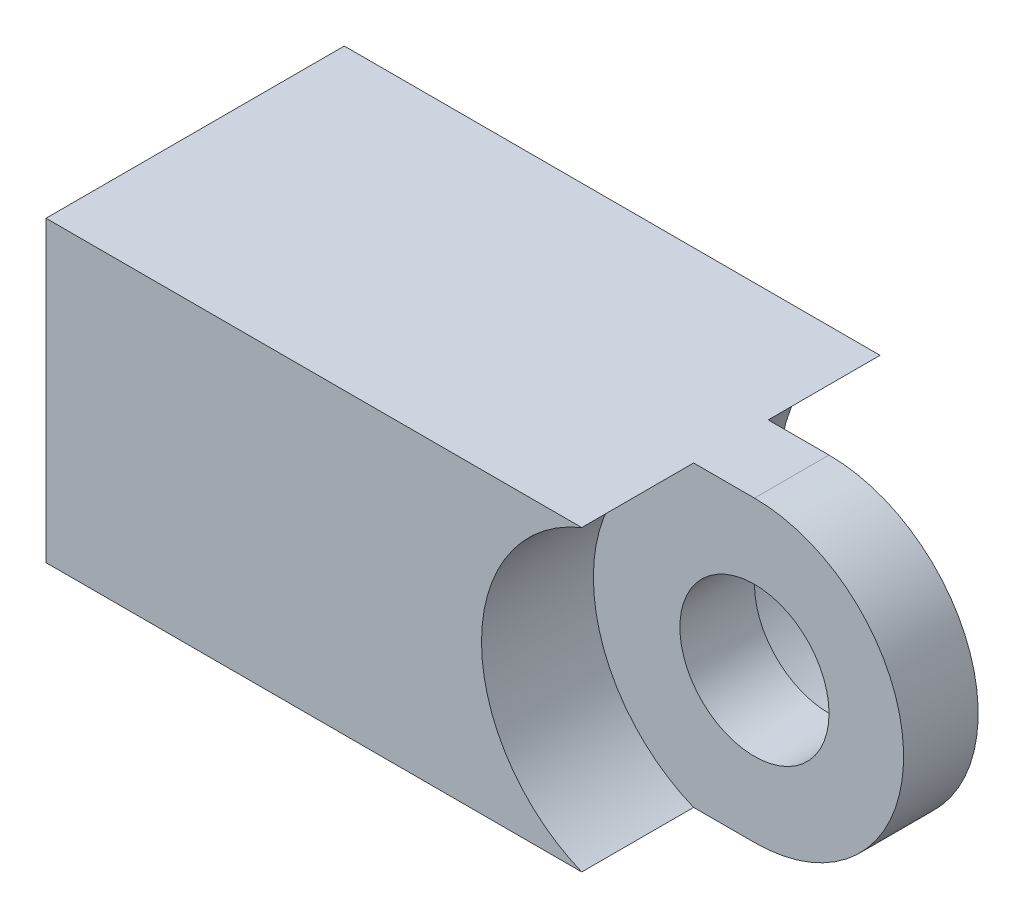
ISO-10303-21;
HEADER;
FILE_DESCRIPTION(('STEP AP214'),'2;1');
FILE_NAME('part.step','',(''),(''),'','','');
FILE_SCHEMA(('AUTOMOTIVE_DESIGN { 1 0 10303 214 1 1 1 1 }'));
ENDSEC;
DATA;
#1=APPLICATION_CONTEXT('core data for automotive mechanical design processes');
#2=APPLICATION_PROTOCOL_DEFINITION('international standard','automotive_design',2000,#1);
#3=PRODUCT_CONTEXT('',#1,'mechanical');
#4=PRODUCT('Part','Part','',(#3));
#5=PRODUCT_RELATED_PRODUCT_CATEGORY('part','',(#4));
#6=PRODUCT_DEFINITION_FORMATION('','',#4);
#7=PRODUCT_DEFINITION_CONTEXT('part definition',#1,'design');
#8=PRODUCT_DEFINITION('design','',#6,#7);
#9=PRODUCT_DEFINITION_SHAPE('','',#8);
#10=(LENGTH_UNIT() NAMED_UNIT(*) SI_UNIT(.MILLI.,.METRE.));
#11=(NAMED_UNIT(*) PLANE_ANGLE_UNIT() SI_UNIT($,.RADIAN.));
#12=(NAMED_UNIT(*) SI_UNIT($,.STERADIAN.) SOLID_ANGLE_UNIT());
#13=UNCERTAINTY_MEASURE_WITH_UNIT(LENGTH_MEASURE(1.E-05),#10,'distance_accuracy_value','');
#14=(GEOMETRIC_REPRESENTATION_CONTEXT(3) GLOBAL_UNCERTAINTY_ASSIGNED_CONTEXT((#13)) GLOBAL_UNIT_ASSIGNED_CONTEXT((#10,
#11,#12)) REPRESENTATION_CONTEXT('',''));
#15=CARTESIAN_POINT('',(0.,0.,0.));
#16=DIRECTION('',(0.,0.,1.));
#17=DIRECTION('',(1.,0.,0.));
#18=AXIS2_PLACEMENT_3D('',#15,#16,#17);
#19=CARTESIAN_POINT('',(0.,0.,0.79375));
#20=DIRECTION('',(0.,0.,-1.));
#21=DIRECTION('',(-1.,0.,0.));
#22=AXIS2_PLACEMENT_3D('',#19,#20,#21);
#23=PLANE('',#22);
#24=CARTESIAN_POINT('',(0.,0.,0.79375));
#25=DIRECTION('',(0.,0.,-1.));
#26=DIRECTION('',(-1.,0.,0.));
#27=AXIS2_PLACEMENT_3D('',#24,#25,#26);
#28=CIRCLE('',#27,3.429);
#29=CARTESIAN_POINT('',(-1.29515095645257,-3.175,0.79375));
#30=VERTEX_POINT('',#29);
#31=CARTESIAN_POINT('',(-1.29515095645257,3.175,0.79375));
#32=VERTEX_POINT('',#31);
#33=EDGE_CURVE('E180',#30,#32,#28,.T.);
#34=ORIENTED_EDGE('',*,*,#33,.F.);
#35=DIRECTION('',(1.,0.,0.));
#36=VECTOR('',#35,1.);
#37=CARTESIAN_POINT('',(-6.35,-3.175,0.79375));
#38=LINE('',#37,#36);
#39=CARTESIAN_POINT('',(0.,-3.175,0.79375));
#40=VERTEX_POINT('',#39);
#41=EDGE_CURVE('E206',#30,#40,#38,.T.);
#42=ORIENTED_EDGE('',*,*,#41,.T.);
#43=CARTESIAN_POINT('',(0.,0.,0.79375));
#44=DIRECTION('',(0.,0.,1.));
#45=DIRECTION('',(-1.,0.,0.));
#46=AXIS2_PLACEMENT_3D('',#43,#44,#45);
#47=CIRCLE('',#46,3.175);
#48=CARTESIAN_POINT('',(0.,3.175,0.79375));
#49=VERTEX_POINT('',#48);
#50=EDGE_CURVE('E73',#40,#49,#47,.T.);
#51=ORIENTED_EDGE('',*,*,#50,.T.);
#52=DIRECTION('',(-1.,0.,0.));
#53=VECTOR('',#52,1.);
#54=CARTESIAN_POINT('',(-6.35,3.175,0.79375));
#55=LINE('',#54,#53);
#56=EDGE_CURVE('E212',#49,#32,#55,.T.);
#57=ORIENTED_EDGE('',*,*,#56,.T.);
#58=EDGE_LOOP('',(#34,#42,#51,#57));
#59=FACE_BOUND('',#58,.T.);
#60=CARTESIAN_POINT('',(0.,0.,0.79375));
#61=DIRECTION('',(0.,0.,1.));
#62=DIRECTION('',(1.,0.,0.));
#63=AXIS2_PLACEMENT_3D('',#60,#61,#62);
#64=CIRCLE('',#63,1.5875);
#65=CARTESIAN_POINT('',(1.5875,0.,0.79375));
#66=VERTEX_POINT('',#65);
#67=EDGE_CURVE('E260',#66,#66,#64,.T.);
#68=ORIENTED_EDGE('',*,*,#67,.F.);
#69=EDGE_LOOP('',(#68));
#70=FACE_BOUND('',#69,.T.);
#71=ADVANCED_FACE('F52',(#59,#70),#23,.F.);
#72=CARTESIAN_POINT('',(0.,0.,-0.79375));
#73=DIRECTION('',(0.,0.,-1.));
#74=DIRECTION('',(-1.,0.,0.));
#75=AXIS2_PLACEMENT_3D('',#72,#73,#74);
#76=PLANE('',#75);
#77=CARTESIAN_POINT('',(0.,0.,-0.79375));
#78=DIRECTION('',(0.,0.,-1.));
#79=DIRECTION('',(-1.,0.,0.));
#80=AXIS2_PLACEMENT_3D('',#77,#78,#79);
#81=CIRCLE('',#80,1.5875);
#82=CARTESIAN_POINT('',(-1.5875,0.,-0.79375));
#83=VERTEX_POINT('',#82);
#84=EDGE_CURVE('E165',#83,#83,#81,.T.);
#85=ORIENTED_EDGE('',*,*,#84,.F.);
#86=EDGE_LOOP('',(#85));
#87=FACE_BOUND('',#86,.T.);
#88=DIRECTION('',(1.,0.,0.));
#89=VECTOR('',#88,1.);
#90=CARTESIAN_POINT('',(-6.35,-3.175,-0.79375));
#91=LINE('',#90,#89);
#92=CARTESIAN_POINT('',(-1.29515095645257,-3.175,-0.79375));
#93=VERTEX_POINT('',#92);
#94=CARTESIAN_POINT('',(0.,-3.175,-0.79375));
#95=VERTEX_POINT('',#94);
#96=EDGE_CURVE('E88',#93,#95,#91,.T.);
#97=ORIENTED_EDGE('',*,*,#96,.F.);
#98=CARTESIAN_POINT('',(0.,0.,-0.79375));
#99=DIRECTION('',(0.,0.,-1.));
#100=DIRECTION('',(-1.,0.,0.));
#101=AXIS2_PLACEMENT_3D('',#98,#99,#100);
#102=CIRCLE('',#101,3.429);
#103=CARTESIAN_POINT('',(-1.29515095645257,3.175,-0.79375));
#104=VERTEX_POINT('',#103);
#105=EDGE_CURVE('E11',#93,#104,#102,.T.);
#106=ORIENTED_EDGE('',*,*,#105,.T.);
#107=DIRECTION('',(-1.,0.,0.));
#108=VECTOR('',#107,1.);
#109=CARTESIAN_POINT('',(-6.35,3.175,-0.79375));
#110=LINE('',#109,#108);
#111=CARTESIAN_POINT('',(0.,3.175,-0.79375));
#112=VERTEX_POINT('',#111);
#113=EDGE_CURVE('E209',#112,#104,#110,.T.);
#114=ORIENTED_EDGE('',*,*,#113,.F.);
#115=CARTESIAN_POINT('',(0.,0.,-0.79375));
#116=DIRECTION('',(0.,0.,1.));
#117=DIRECTION('',(-1.,0.,0.));
#118=AXIS2_PLACEMENT_3D('',#115,#116,#117);
#119=CIRCLE('',#118,3.175);
#120=EDGE_CURVE('E218',#95,#112,#119,.T.);
#121=ORIENTED_EDGE('',*,*,#120,.F.);
#122=EDGE_LOOP('',(#97,#106,#114,#121));
#123=FACE_BOUND('',#122,.T.);
#124=ADVANCED_FACE('F232',(#87,#123),#76,.T.);
#125=CARTESIAN_POINT('',(-6.35,-3.175,0.79375));
#126=DIRECTION('',(0.,1.,0.));
#127=DIRECTION('',(-1.,0.,0.));
#128=AXIS2_PLACEMENT_3D('',#125,#126,#127);
#129=PLANE('',#128);
#130=DIRECTION('',(0.,0.,-1.));
#131=VECTOR('',#130,1.);
#132=CARTESIAN_POINT('',(-1.29515095645257,-3.175,3.175));
#133=LINE('',#132,#131);
#134=CARTESIAN_POINT('',(-1.29515095645257,-3.175,-3.175));
#135=VERTEX_POINT('',#134);
#136=EDGE_CURVE('E176',#93,#135,#133,.T.);
#137=ORIENTED_EDGE('',*,*,#136,.F.);
#138=ORIENTED_EDGE('',*,*,#96,.T.);
#139=DIRECTION('',(0.,0.,-1.));
#140=VECTOR('',#139,1.);
#141=CARTESIAN_POINT('',(0.,-3.175,0.79375));
#142=LINE('',#141,#140);
#143=EDGE_CURVE('E62',#40,#95,#142,.T.);
#144=ORIENTED_EDGE('',*,*,#143,.F.);
#145=ORIENTED_EDGE('',*,*,#41,.F.);
#146=CARTESIAN_POINT('',(-1.29515095645257,-3.175,3.175));
#147=VERTEX_POINT('',#146);
#148=EDGE_CURVE('E177',#147,#30,#133,.T.);
#149=ORIENTED_EDGE('',*,*,#148,.F.);
#150=DIRECTION('',(1.,0.,0.));
#151=VECTOR('',#150,1.);
#152=CARTESIAN_POINT('',(-12.7,-3.175,3.175));
#153=LINE('',#152,#151);
#154=CARTESIAN_POINT('',(-12.7,-3.175,3.175));
#155=VERTEX_POINT('',#154);
#156=EDGE_CURVE('E194',#155,#147,#153,.T.);
#157=ORIENTED_EDGE('',*,*,#156,.F.);
#158=DIRECTION('',(0.,0.,1.));
#159=VECTOR('',#158,1.);
#160=CARTESIAN_POINT('',(-12.7,-3.175,-3.175));
#161=LINE('',#160,#159);
#162=CARTESIAN_POINT('',(-12.7,-3.175,-3.175));
#163=VERTEX_POINT('',#162);
#164=EDGE_CURVE('E101',#163,#155,#161,.T.);
#165=ORIENTED_EDGE('',*,*,#164,.F.);
#166=DIRECTION('',(1.,0.,0.));
#167=VECTOR('',#166,1.);
#168=CARTESIAN_POINT('',(-12.7,-3.175,-3.175));
#169=LINE('',#168,#167);
#170=EDGE_CURVE('E197',#163,#135,#169,.T.);
#171=ORIENTED_EDGE('',*,*,#170,.T.);
#172=EDGE_LOOP('',(#137,#138,#144,#145,#149,#157,#165,#171));
#173=FACE_BOUND('',#172,.T.);
#174=ADVANCED_FACE('F54',(#173),#129,.F.);
#175=CARTESIAN_POINT('',(0.,0.,0.79375));
#176=DIRECTION('',(0.,0.,-1.));
#177=DIRECTION('',(-1.,0.,0.));
#178=AXIS2_PLACEMENT_3D('',#175,#176,#177);
#179=CYLINDRICAL_SURFACE('',#178,3.175);
#180=ORIENTED_EDGE('',*,*,#120,.T.);
#181=DIRECTION('',(0.,0.,-1.));
#182=VECTOR('',#181,1.);
#183=CARTESIAN_POINT('',(0.,3.175,0.79375));
#184=LINE('',#183,#182);
#185=EDGE_CURVE('E215',#49,#112,#184,.T.);
#186=ORIENTED_EDGE('',*,*,#185,.F.);
#187=ORIENTED_EDGE('',*,*,#50,.F.);
#188=ORIENTED_EDGE('',*,*,#143,.T.);
#189=EDGE_LOOP('',(#180,#186,#187,#188));
#190=FACE_BOUND('',#189,.T.);
#191=ADVANCED_FACE('F228',(#190),#179,.T.);
#192=CARTESIAN_POINT('',(-6.35,3.175,0.79375));
#193=DIRECTION('',(0.,-1.,0.));
#194=DIRECTION('',(0.,0.,-1.));
#195=AXIS2_PLACEMENT_3D('',#192,#193,#194);
#196=PLANE('',#195);
#197=DIRECTION('',(0.,0.,-1.));
#198=VECTOR('',#197,1.);
#199=CARTESIAN_POINT('',(-1.29515095645257,3.175,3.175));
#200=LINE('',#199,#198);
#201=CARTESIAN_POINT('',(-1.29515095645257,3.175,3.175));
#202=VERTEX_POINT('',#201);
#203=EDGE_CURVE('E172',#202,#32,#200,.T.);
#204=ORIENTED_EDGE('',*,*,#203,.T.);
#205=ORIENTED_EDGE('',*,*,#56,.F.);
#206=ORIENTED_EDGE('',*,*,#185,.T.);
#207=ORIENTED_EDGE('',*,*,#113,.T.);
#208=CARTESIAN_POINT('',(-1.29515095645257,3.175,-3.175));
#209=VERTEX_POINT('',#208);
#210=EDGE_CURVE('E170',#104,#209,#200,.T.);
#211=ORIENTED_EDGE('',*,*,#210,.T.);
#212=DIRECTION('',(1.,0.,0.));
#213=VECTOR('',#212,1.);
#214=CARTESIAN_POINT('',(-12.7,3.175,-3.175));
#215=LINE('',#214,#213);
#216=CARTESIAN_POINT('',(-12.7,3.175,-3.175));
#217=VERTEX_POINT('',#216);
#218=EDGE_CURVE('E200',#217,#209,#215,.T.);
#219=ORIENTED_EDGE('',*,*,#218,.F.);
#220=DIRECTION('',(0.,0.,-1.));
#221=VECTOR('',#220,1.);
#222=CARTESIAN_POINT('',(-12.7,3.175,-3.175));
#223=LINE('',#222,#221);
#224=CARTESIAN_POINT('',(-12.7,3.175,3.175));
#225=VERTEX_POINT('',#224);
#226=EDGE_CURVE('E186',#225,#217,#223,.T.);
#227=ORIENTED_EDGE('',*,*,#226,.F.);
#228=DIRECTION('',(1.,0.,0.));
#229=VECTOR('',#228,1.);
#230=CARTESIAN_POINT('',(-12.7,3.175,3.175));
#231=LINE('',#230,#229);
#232=EDGE_CURVE('E203',#225,#202,#231,.T.);
#233=ORIENTED_EDGE('',*,*,#232,.T.);
#234=EDGE_LOOP('',(#204,#205,#206,#207,#211,#219,#227,#233));
#235=FACE_BOUND('',#234,.T.);
#236=ADVANCED_FACE('F235',(#235),#196,.F.);
#237=CARTESIAN_POINT('',(-12.7,3.175,3.175));
#238=DIRECTION('',(0.,0.,-1.));
#239=DIRECTION('',(-1.,0.,0.));
#240=AXIS2_PLACEMENT_3D('',#237,#238,#239);
#241=PLANE('',#240);
#242=ORIENTED_EDGE('',*,*,#156,.T.);
#243=CARTESIAN_POINT('',(0.,0.,3.175));
#244=DIRECTION('',(0.,0.,-1.));
#245=DIRECTION('',(-1.,0.,0.));
#246=AXIS2_PLACEMENT_3D('',#243,#244,#245);
#247=CIRCLE('',#246,3.429);
#248=EDGE_CURVE('E161',#147,#202,#247,.T.);
#249=ORIENTED_EDGE('',*,*,#248,.T.);
#250=ORIENTED_EDGE('',*,*,#232,.F.);
#251=DIRECTION('',(0.,1.,0.));
#252=VECTOR('',#251,1.);
#253=CARTESIAN_POINT('',(-12.7,3.175,3.175));
#254=LINE('',#253,#252);
#255=EDGE_CURVE('E183',#155,#225,#254,.T.);
#256=ORIENTED_EDGE('',*,*,#255,.F.);
#257=EDGE_LOOP('',(#242,#249,#250,#256));
#258=FACE_BOUND('',#257,.T.);
#259=ADVANCED_FACE('F248',(#258),#241,.F.);
#260=CARTESIAN_POINT('',(-12.7,3.175,-3.175));
#261=DIRECTION('',(0.,0.,1.));
#262=DIRECTION('',(0.,-1.,0.));
#263=AXIS2_PLACEMENT_3D('',#260,#261,#262);
#264=PLANE('',#263);
#265=ORIENTED_EDGE('',*,*,#218,.T.);
#266=CARTESIAN_POINT('',(0.,0.,-3.175));
#267=DIRECTION('',(0.,0.,-1.));
#268=DIRECTION('',(-1.,0.,0.));
#269=AXIS2_PLACEMENT_3D('',#266,#267,#268);
#270=CIRCLE('',#269,3.429);
#271=EDGE_CURVE('E154',#135,#209,#270,.T.);
#272=ORIENTED_EDGE('',*,*,#271,.F.);
#273=ORIENTED_EDGE('',*,*,#170,.F.);
#274=DIRECTION('',(0.,-1.,0.));
#275=VECTOR('',#274,1.);
#276=CARTESIAN_POINT('',(-12.7,3.175,-3.175));
#277=LINE('',#276,#275);
#278=EDGE_CURVE('E189',#217,#163,#277,.T.);
#279=ORIENTED_EDGE('',*,*,#278,.F.);
#280=EDGE_LOOP('',(#265,#272,#273,#279));
#281=FACE_BOUND('',#280,.T.);
#282=ADVANCED_FACE('F254',(#281),#264,.F.);
#283=CARTESIAN_POINT('',(-12.7,0.,0.));
#284=DIRECTION('',(-1.,0.,0.));
#285=DIRECTION('',(0.,-1.,0.));
#286=AXIS2_PLACEMENT_3D('',#283,#284,#285);
#287=PLANE('',#286);
#288=CARTESIAN_POINT('',(-12.7,0.,0.));
#289=DIRECTION('',(-1.,0.,0.));
#290=DIRECTION('',(0.,0.,1.));
#291=AXIS2_PLACEMENT_3D('',#288,#289,#290);
#292=CIRCLE('',#291,1.1303);
#293=CARTESIAN_POINT('',(-12.7,0.,1.1303));
#294=VERTEX_POINT('',#293);
#295=EDGE_CURVE('E155',#294,#294,#292,.T.);
#296=ORIENTED_EDGE('',*,*,#295,.F.);
#297=EDGE_LOOP('',(#296));
#298=FACE_BOUND('',#297,.T.);
#299=ORIENTED_EDGE('',*,*,#255,.T.);
#300=ORIENTED_EDGE('',*,*,#226,.T.);
#301=ORIENTED_EDGE('',*,*,#278,.T.);
#302=ORIENTED_EDGE('',*,*,#164,.T.);
#303=EDGE_LOOP('',(#299,#300,#301,#302));
#304=FACE_BOUND('',#303,.T.);
#305=ADVANCED_FACE('F249',(#298,#304),#287,.T.);
#306=CARTESIAN_POINT('',(0.,0.,3.175));
#307=DIRECTION('',(0.,0.,-1.));
#308=DIRECTION('',(-1.,0.,0.));
#309=AXIS2_PLACEMENT_3D('',#306,#307,#308);
#310=CYLINDRICAL_SURFACE('',#309,3.429);
#311=ORIENTED_EDGE('',*,*,#148,.T.);
#312=ORIENTED_EDGE('',*,*,#33,.T.);
#313=ORIENTED_EDGE('',*,*,#203,.F.);
#314=ORIENTED_EDGE('',*,*,#248,.F.);
#315=EDGE_LOOP('',(#311,#312,#313,#314));
#316=FACE_BOUND('',#315,.T.);
#317=ADVANCED_FACE('F245',(#316),#310,.F.);
#318=ORIENTED_EDGE('',*,*,#105,.F.);
#319=ORIENTED_EDGE('',*,*,#136,.T.);
#320=ORIENTED_EDGE('',*,*,#271,.T.);
#321=ORIENTED_EDGE('',*,*,#210,.F.);
#322=EDGE_LOOP('',(#318,#319,#320,#321));
#323=FACE_BOUND('',#322,.T.);
#324=ADVANCED_FACE('F147',(#323),#310,.F.);
#325=CARTESIAN_POINT('',(-4.191,0.,0.));
#326=DIRECTION('',(-1.,0.,0.));
#327=DIRECTION('',(0.,0.,1.));
#328=AXIS2_PLACEMENT_3D('',#325,#326,#327);
#329=CONICAL_SURFACE('',#328,1.1303,1.02974425867665);
#330=CARTESIAN_POINT('',(-3.51184724231315,0.,0.));
#331=VERTEX_POINT('',#330);
#332=VERTEX_LOOP('',#331);
#333=FACE_BOUND('',#332,.T.);
#334=CARTESIAN_POINT('',(-4.191,0.,0.));
#335=DIRECTION('',(-1.,0.,0.));
#336=DIRECTION('',(0.,0.,1.));
#337=AXIS2_PLACEMENT_3D('',#334,#335,#336);
#338=CIRCLE('',#337,1.1303);
#339=CARTESIAN_POINT('',(-4.191,0.,1.1303));
#340=VERTEX_POINT('',#339);
#341=EDGE_CURVE('E151',#340,#340,#338,.T.);
#342=ORIENTED_EDGE('',*,*,#341,.T.);
#343=EDGE_LOOP('',(#342));
#344=FACE_BOUND('',#343,.T.);
#345=ADVANCED_FACE('F143',(#333,#344),#329,.F.);
#346=CARTESIAN_POINT('',(-12.7,0.,0.));
#347=DIRECTION('',(-1.,0.,0.));
#348=DIRECTION('',(0.,0.,1.));
#349=AXIS2_PLACEMENT_3D('',#346,#347,#348);
#350=CYLINDRICAL_SURFACE('',#349,1.1303);
#351=ORIENTED_EDGE('',*,*,#341,.F.);
#352=EDGE_LOOP('',(#351));
#353=FACE_BOUND('',#352,.T.);
#354=ORIENTED_EDGE('',*,*,#295,.T.);
#355=EDGE_LOOP('',(#354));
#356=FACE_BOUND('',#355,.T.);
#357=ADVANCED_FACE('F146',(#353,#356),#350,.F.);
#358=CARTESIAN_POINT('',(0.,0.,0.79375));
#359=DIRECTION('',(0.,0.,1.));
#360=DIRECTION('',(1.,0.,0.));
#361=AXIS2_PLACEMENT_3D('',#358,#359,#360);
#362=CYLINDRICAL_SURFACE('',#361,1.5875);
#363=ORIENTED_EDGE('',*,*,#67,.T.);
#364=EDGE_LOOP('',(#363));
#365=FACE_BOUND('',#364,.T.);
#366=ORIENTED_EDGE('',*,*,#84,.T.);
#367=EDGE_LOOP('',(#366));
#368=FACE_BOUND('',#367,.T.);
#369=ADVANCED_FACE('F268',(#365,#368),#362,.F.);
#370=CLOSED_SHELL('',(#71,#124,#174,#191,#236,#259,#282,#305,#317,#324,#345,#357,#369));
#371=MANIFOLD_SOLID_BREP('B2',#370);
#372=ADVANCED_BREP_SHAPE_REPRESENTATION('',(#18,#371),#14);
#373=SHAPE_DEFINITION_REPRESENTATION(#9,#372);
ENDSEC;
END-ISO-10303-21;
